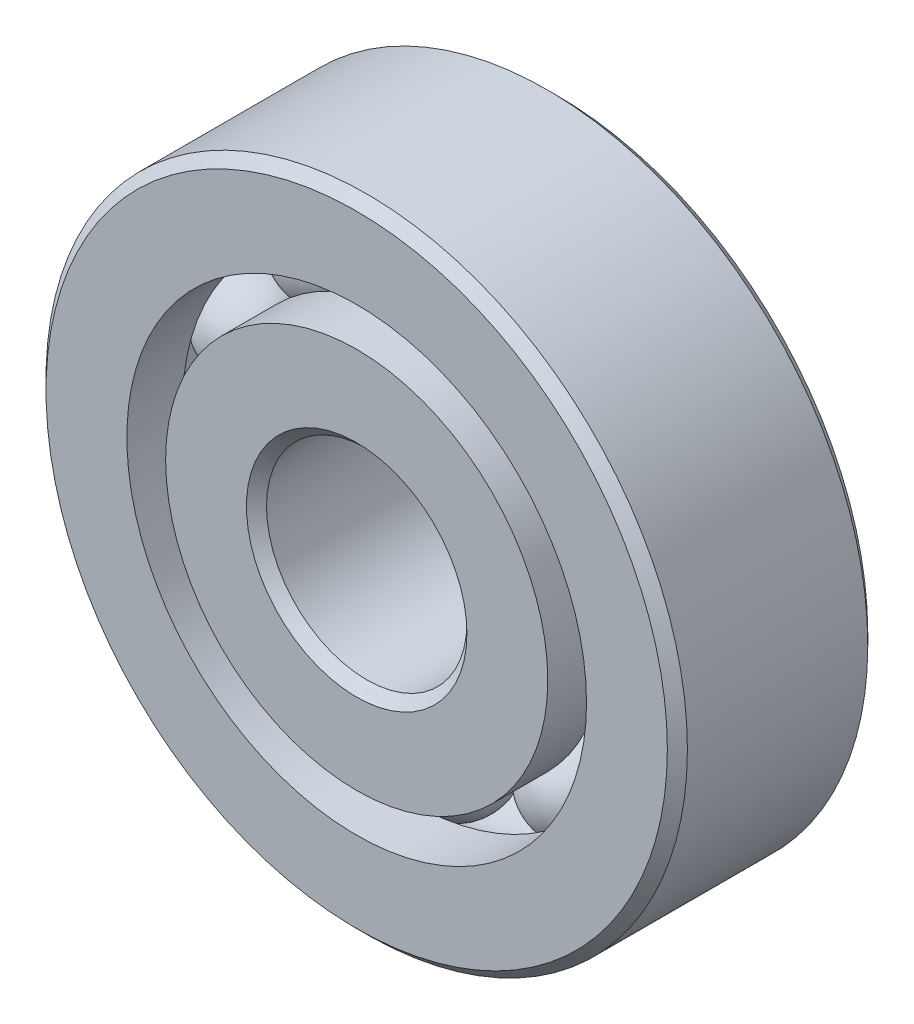
ISO-10303-21;
HEADER;
FILE_DESCRIPTION(('STEP AP214'),'2;1');
FILE_NAME('part.step','',(''),(''),'','','');
FILE_SCHEMA(('AUTOMOTIVE_DESIGN { 1 0 10303 214 1 1 1 1 }'));
ENDSEC;
DATA;
#1=APPLICATION_CONTEXT('core data for automotive mechanical design processes');
#2=APPLICATION_PROTOCOL_DEFINITION('international standard','automotive_design',2000,#1);
#3=PRODUCT_CONTEXT('',#1,'mechanical');
#4=PRODUCT('Part','Part','',(#3));
#5=PRODUCT_RELATED_PRODUCT_CATEGORY('part','',(#4));
#6=PRODUCT_DEFINITION_FORMATION('','',#4);
#7=PRODUCT_DEFINITION_CONTEXT('part definition',#1,'design');
#8=PRODUCT_DEFINITION('design','',#6,#7);
#9=PRODUCT_DEFINITION_SHAPE('','',#8);
#10=(LENGTH_UNIT() NAMED_UNIT(*) SI_UNIT(.MILLI.,.METRE.));
#11=(NAMED_UNIT(*) PLANE_ANGLE_UNIT() SI_UNIT($,.RADIAN.));
#12=(NAMED_UNIT(*) SI_UNIT($,.STERADIAN.) SOLID_ANGLE_UNIT());
#13=UNCERTAINTY_MEASURE_WITH_UNIT(LENGTH_MEASURE(1.E-05),#10,'distance_accuracy_value','');
#14=(GEOMETRIC_REPRESENTATION_CONTEXT(3) GLOBAL_UNCERTAINTY_ASSIGNED_CONTEXT((#13)) GLOBAL_UNIT_ASSIGNED_CONTEXT((#10,
#11,#12)) REPRESENTATION_CONTEXT('',''));
#15=CARTESIAN_POINT('',(0.,0.,0.));
#16=DIRECTION('',(0.,0.,1.));
#17=DIRECTION('',(1.,0.,0.));
#18=AXIS2_PLACEMENT_3D('',#15,#16,#17);
#19=CARTESIAN_POINT('',(-3.08587257453541,4.24733922046844,0.));
#20=DIRECTION('',(0.,0.,1.));
#21=DIRECTION('',(-0.587785252292463,0.809016994374955,0.));
#22=AXIS2_PLACEMENT_3D('',#19,#20,#21);
#23=SPHERICAL_SURFACE('',#22,1.21175743903915);
#24=CARTESIAN_POINT('',(-3.08587257453541,4.24733922046844,1.21175743903915));
#25=VERTEX_POINT('',#24);
#26=VERTEX_LOOP('',#25);
#27=FACE_BOUND('',#26,.T.);
#28=ADVANCED_FACE('F39',(#27),#23,.T.);
#29=CLOSED_SHELL('',(#28));
#30=MANIFOLD_SOLID_BREP('B2',#29);
#31=CARTESIAN_POINT('',(-4.99304671054945,1.62233922046853,0.));
#32=DIRECTION('',(0.,0.,1.));
#33=DIRECTION('',(-0.95105651629515,0.309016994374958,0.));
#34=AXIS2_PLACEMENT_3D('',#31,#32,#33);
#35=SPHERICAL_SURFACE('',#34,1.21175743903915);
#36=CARTESIAN_POINT('',(-4.99304671054945,1.62233922046853,1.21175743903915));
#37=VERTEX_POINT('',#36);
#38=VERTEX_LOOP('',#37);
#39=FACE_BOUND('',#38,.T.);
#40=ADVANCED_FACE('F57',(#39),#35,.T.);
#41=CLOSED_SHELL('',(#40));
#42=MANIFOLD_SOLID_BREP('B6',#41);
#43=CARTESIAN_POINT('',(-4.99304671054951,-1.62233922046848,0.));
#44=DIRECTION('',(0.,0.,1.));
#45=DIRECTION('',(-0.951056516295157,-0.309016994374938,0.));
#46=AXIS2_PLACEMENT_3D('',#43,#44,#45);
#47=SPHERICAL_SURFACE('',#46,1.21175743903915);
#48=CARTESIAN_POINT('',(-4.99304671054951,-1.62233922046848,1.21175743903915));
#49=VERTEX_POINT('',#48);
#50=VERTEX_LOOP('',#49);
#51=FACE_BOUND('',#50,.T.);
#52=ADVANCED_FACE('F75',(#51),#47,.T.);
#53=CLOSED_SHELL('',(#52));
#54=MANIFOLD_SOLID_BREP('B35',#53);
#55=CARTESIAN_POINT('',(-3.08587257453552,-4.24733922046844,0.));
#56=DIRECTION('',(0.,0.,1.));
#57=DIRECTION('',(-0.58778525229248,-0.809016994374942,0.));
#58=AXIS2_PLACEMENT_3D('',#55,#56,#57);
#59=SPHERICAL_SURFACE('',#58,1.21175743903915);
#60=CARTESIAN_POINT('',(-3.08587257453552,-4.24733922046844,1.21175743903915));
#61=VERTEX_POINT('',#60);
#62=VERTEX_LOOP('',#61);
#63=FACE_BOUND('',#62,.T.);
#64=ADVANCED_FACE('F93',(#63),#59,.T.);
#65=CLOSED_SHELL('',(#64));
#66=MANIFOLD_SOLID_BREP('B53',#65);
#67=CARTESIAN_POINT('',(0.,-5.25000000000003,0.));
#68=DIRECTION('',(0.,0.,1.));
#69=DIRECTION('',(0.,-1.,0.));
#70=AXIS2_PLACEMENT_3D('',#67,#68,#69);
#71=SPHERICAL_SURFACE('',#70,1.21175743903915);
#72=CARTESIAN_POINT('',(0.,-5.25000000000003,1.21175743903915));
#73=VERTEX_POINT('',#72);
#74=VERTEX_LOOP('',#73);
#75=FACE_BOUND('',#74,.T.);
#76=ADVANCED_FACE('F111',(#75),#71,.T.);
#77=CLOSED_SHELL('',(#76));
#78=MANIFOLD_SOLID_BREP('B71',#77);
#79=CARTESIAN_POINT('',(3.08587257453552,-4.24733922046847,0.));
#80=DIRECTION('',(0.,0.,1.));
#81=DIRECTION('',(0.587785252292469,-0.809016994374951,0.));
#82=AXIS2_PLACEMENT_3D('',#79,#80,#81);
#83=SPHERICAL_SURFACE('',#82,1.21175743903915);
#84=CARTESIAN_POINT('',(3.08587257453552,-4.24733922046847,1.21175743903915));
#85=VERTEX_POINT('',#84);
#86=VERTEX_LOOP('',#85);
#87=FACE_BOUND('',#86,.T.);
#88=ADVANCED_FACE('F129',(#87),#83,.T.);
#89=CLOSED_SHELL('',(#88));
#90=MANIFOLD_SOLID_BREP('B89',#89);
#91=CARTESIAN_POINT('',(4.99304671054962,-1.62233922046853,0.));
#92=DIRECTION('',(0.,0.,1.));
#93=DIRECTION('',(0.951056516295153,-0.309016994374952,0.));
#94=AXIS2_PLACEMENT_3D('',#91,#92,#93);
#95=SPHERICAL_SURFACE('',#94,1.21175743903915);
#96=CARTESIAN_POINT('',(4.99304671054962,-1.62233922046853,1.21175743903915));
#97=VERTEX_POINT('',#96);
#98=VERTEX_LOOP('',#97);
#99=FACE_BOUND('',#98,.T.);
#100=ADVANCED_FACE('F147',(#99),#95,.T.);
#101=CLOSED_SHELL('',(#100));
#102=MANIFOLD_SOLID_BREP('B107',#101);
#103=CARTESIAN_POINT('',(4.99304671054962,1.62233922046845,0.));
#104=DIRECTION('',(0.,0.,1.));
#105=DIRECTION('',(0.951056516295155,0.309016994374945,0.));
#106=AXIS2_PLACEMENT_3D('',#103,#104,#105);
#107=SPHERICAL_SURFACE('',#106,1.21175743903915);
#108=CARTESIAN_POINT('',(4.99304671054962,1.62233922046845,1.21175743903915));
#109=VERTEX_POINT('',#108);
#110=VERTEX_LOOP('',#109);
#111=FACE_BOUND('',#110,.T.);
#112=ADVANCED_FACE('F168',(#111),#107,.T.);
#113=CLOSED_SHELL('',(#112));
#114=MANIFOLD_SOLID_BREP('B125',#113);
#115=CARTESIAN_POINT('',(3.08587257453552,4.24733922046844,0.));
#116=DIRECTION('',(0.,0.,1.));
#117=DIRECTION('',(0.587785252292474,0.809016994374947,0.));
#118=AXIS2_PLACEMENT_3D('',#115,#116,#117);
#119=SPHERICAL_SURFACE('',#118,1.21175743903915);
#120=CARTESIAN_POINT('',(3.08587257453552,4.24733922046844,1.21175743903915));
#121=VERTEX_POINT('',#120);
#122=VERTEX_LOOP('',#121);
#123=FACE_BOUND('',#122,.T.);
#124=ADVANCED_FACE('F189',(#123),#119,.T.);
#125=CLOSED_SHELL('',(#124));
#126=MANIFOLD_SOLID_BREP('B143',#125);
#127=CARTESIAN_POINT('',(0.,5.24999999999998,0.));
#128=DIRECTION('',(0.,0.,1.));
#129=DIRECTION('',(0.,1.,0.));
#130=AXIS2_PLACEMENT_3D('',#127,#128,#129);
#131=SPHERICAL_SURFACE('',#130,1.21175743903915);
#132=CARTESIAN_POINT('',(0.,5.24999999999998,1.21175743903915));
#133=VERTEX_POINT('',#132);
#134=VERTEX_LOOP('',#133);
#135=FACE_BOUND('',#134,.T.);
#136=ADVANCED_FACE('F212',(#135),#131,.T.);
#137=CLOSED_SHELL('',(#136));
#138=MANIFOLD_SOLID_BREP('B164',#137);
#139=CARTESIAN_POINT('',(0.,4.76648351648354,2.5));
#140=DIRECTION('',(0.,0.,-1.));
#141=DIRECTION('',(-1.,0.,0.));
#142=AXIS2_PLACEMENT_3D('',#139,#140,#141);
#143=PLANE('',#142);
#144=CARTESIAN_POINT('',(0.,0.,2.5));
#145=DIRECTION('',(0.,0.,1.));
#146=DIRECTION('',(1.,0.,0.));
#147=AXIS2_PLACEMENT_3D('',#144,#145,#146);
#148=CIRCLE('',#147,2.75);
#149=CARTESIAN_POINT('',(2.75,0.,2.5));
#150=VERTEX_POINT('',#149);
#151=EDGE_CURVE('E260',#150,#150,#148,.T.);
#152=ORIENTED_EDGE('',*,*,#151,.F.);
#153=EDGE_LOOP('',(#152));
#154=FACE_BOUND('',#153,.T.);
#155=CARTESIAN_POINT('',(0.,0.,2.5));
#156=DIRECTION('',(0.,0.,1.));
#157=DIRECTION('',(1.,0.,0.));
#158=AXIS2_PLACEMENT_3D('',#155,#156,#157);
#159=CIRCLE('',#158,4.76648351648352);
#160=CARTESIAN_POINT('',(4.76648351648352,0.,2.5));
#161=VERTEX_POINT('',#160);
#162=EDGE_CURVE('E211',#161,#161,#159,.T.);
#163=ORIENTED_EDGE('',*,*,#162,.T.);
#164=EDGE_LOOP('',(#163));
#165=FACE_BOUND('',#164,.T.);
#166=ADVANCED_FACE('F232',(#154,#165),#143,.F.);
#167=CARTESIAN_POINT('',(0.,0.,2.5));
#168=DIRECTION('',(0.,0.,1.));
#169=DIRECTION('',(1.,0.,0.));
#170=AXIS2_PLACEMENT_3D('',#167,#168,#169);
#171=CYLINDRICAL_SURFACE('',#170,4.76648351648352);
#172=ORIENTED_EDGE('',*,*,#162,.F.);
#173=EDGE_LOOP('',(#172));
#174=FACE_BOUND('',#173,.T.);
#175=CARTESIAN_POINT('',(0.,0.,1.11111111111112));
#176=DIRECTION('',(0.,0.,1.));
#177=DIRECTION('',(1.,0.,0.));
#178=AXIS2_PLACEMENT_3D('',#175,#176,#177);
#179=CIRCLE('',#178,4.76648351648352);
#180=CARTESIAN_POINT('',(4.76648351648352,0.,1.11111111111112));
#181=VERTEX_POINT('',#180);
#182=EDGE_CURVE('E238',#181,#181,#179,.T.);
#183=ORIENTED_EDGE('',*,*,#182,.T.);
#184=EDGE_LOOP('',(#183));
#185=FACE_BOUND('',#184,.T.);
#186=ADVANCED_FACE('F267',(#174,#185),#171,.T.);
#187=CARTESIAN_POINT('',(0.,0.,0.));
#188=DIRECTION('',(0.,0.,1.));
#189=DIRECTION('',(1.,0.,0.));
#190=AXIS2_PLACEMENT_3D('',#187,#188,#189);
#191=TOROIDAL_SURFACE('',#190,5.25,1.21175743903915);
#192=ORIENTED_EDGE('',*,*,#182,.F.);
#193=EDGE_LOOP('',(#192));
#194=FACE_BOUND('',#193,.T.);
#195=CARTESIAN_POINT('',(0.,0.,-1.11111111111112));
#196=DIRECTION('',(0.,0.,1.));
#197=DIRECTION('',(1.,0.,0.));
#198=AXIS2_PLACEMENT_3D('',#195,#196,#197);
#199=CIRCLE('',#198,4.76648351648352);
#200=CARTESIAN_POINT('',(4.76648351648352,0.,-1.11111111111112));
#201=VERTEX_POINT('',#200);
#202=EDGE_CURVE('E242',#201,#201,#199,.T.);
#203=ORIENTED_EDGE('',*,*,#202,.T.);
#204=EDGE_LOOP('',(#203));
#205=FACE_BOUND('',#204,.T.);
#206=ADVANCED_FACE('F271',(#194,#205),#191,.F.);
#207=CARTESIAN_POINT('',(0.,0.,2.5));
#208=DIRECTION('',(0.,0.,1.));
#209=DIRECTION('',(1.,0.,0.));
#210=AXIS2_PLACEMENT_3D('',#207,#208,#209);
#211=CYLINDRICAL_SURFACE('',#210,4.76648351648352);
#212=ORIENTED_EDGE('',*,*,#202,.F.);
#213=EDGE_LOOP('',(#212));
#214=FACE_BOUND('',#213,.T.);
#215=CARTESIAN_POINT('',(0.,0.,-2.5));
#216=DIRECTION('',(0.,0.,1.));
#217=DIRECTION('',(1.,0.,0.));
#218=AXIS2_PLACEMENT_3D('',#215,#216,#217);
#219=CIRCLE('',#218,4.76648351648352);
#220=CARTESIAN_POINT('',(4.76648351648352,0.,-2.5));
#221=VERTEX_POINT('',#220);
#222=EDGE_CURVE('E246',#221,#221,#219,.T.);
#223=ORIENTED_EDGE('',*,*,#222,.T.);
#224=EDGE_LOOP('',(#223));
#225=FACE_BOUND('',#224,.T.);
#226=ADVANCED_FACE('F276',(#214,#225),#211,.T.);
#227=CARTESIAN_POINT('',(0.,2.74999999999992,-2.5));
#228=DIRECTION('',(0.,0.,1.));
#229=DIRECTION('',(1.,0.,0.));
#230=AXIS2_PLACEMENT_3D('',#227,#228,#229);
#231=PLANE('',#230);
#232=ORIENTED_EDGE('',*,*,#222,.F.);
#233=EDGE_LOOP('',(#232));
#234=FACE_BOUND('',#233,.T.);
#235=CARTESIAN_POINT('',(0.,0.,-2.5));
#236=DIRECTION('',(0.,0.,1.));
#237=DIRECTION('',(1.,0.,0.));
#238=AXIS2_PLACEMENT_3D('',#235,#236,#237);
#239=CIRCLE('',#238,2.75);
#240=CARTESIAN_POINT('',(2.75,0.,-2.5));
#241=VERTEX_POINT('',#240);
#242=EDGE_CURVE('E251',#241,#241,#239,.T.);
#243=ORIENTED_EDGE('',*,*,#242,.T.);
#244=EDGE_LOOP('',(#243));
#245=FACE_BOUND('',#244,.T.);
#246=ADVANCED_FACE('F282',(#234,#245),#231,.F.);
#247=CARTESIAN_POINT('',(0.,0.,-2.24999999999997));
#248=DIRECTION('',(0.,0.,-1.));
#249=DIRECTION('',(-1.,0.,0.));
#250=AXIS2_PLACEMENT_3D('',#247,#248,#249);
#251=CONICAL_SURFACE('',#250,2.5,0.785398163397444);
#252=ORIENTED_EDGE('',*,*,#242,.F.);
#253=EDGE_LOOP('',(#252));
#254=FACE_BOUND('',#253,.T.);
#255=CARTESIAN_POINT('',(0.,0.,-2.24999999999997));
#256=DIRECTION('',(0.,0.,1.));
#257=DIRECTION('',(1.,0.,0.));
#258=AXIS2_PLACEMENT_3D('',#255,#256,#257);
#259=CIRCLE('',#258,2.5);
#260=CARTESIAN_POINT('',(2.5,0.,-2.24999999999997));
#261=VERTEX_POINT('',#260);
#262=EDGE_CURVE('E254',#261,#261,#259,.T.);
#263=ORIENTED_EDGE('',*,*,#262,.T.);
#264=EDGE_LOOP('',(#263));
#265=FACE_BOUND('',#264,.T.);
#266=ADVANCED_FACE('F286',(#254,#265),#251,.F.);
#267=CARTESIAN_POINT('',(0.,0.,2.5));
#268=DIRECTION('',(0.,0.,1.));
#269=DIRECTION('',(1.,0.,0.));
#270=AXIS2_PLACEMENT_3D('',#267,#268,#269);
#271=CYLINDRICAL_SURFACE('',#270,2.5);
#272=ORIENTED_EDGE('',*,*,#262,.F.);
#273=EDGE_LOOP('',(#272));
#274=FACE_BOUND('',#273,.T.);
#275=CARTESIAN_POINT('',(0.,0.,2.24999999999997));
#276=DIRECTION('',(0.,0.,1.));
#277=DIRECTION('',(1.,0.,0.));
#278=AXIS2_PLACEMENT_3D('',#275,#276,#277);
#279=CIRCLE('',#278,2.5);
#280=CARTESIAN_POINT('',(2.5,0.,2.24999999999997));
#281=VERTEX_POINT('',#280);
#282=EDGE_CURVE('E257',#281,#281,#279,.T.);
#283=ORIENTED_EDGE('',*,*,#282,.T.);
#284=EDGE_LOOP('',(#283));
#285=FACE_BOUND('',#284,.T.);
#286=ADVANCED_FACE('F290',(#274,#285),#271,.F.);
#287=CARTESIAN_POINT('',(0.,0.,2.5));
#288=DIRECTION('',(0.,0.,1.));
#289=DIRECTION('',(1.,0.,0.));
#290=AXIS2_PLACEMENT_3D('',#287,#288,#289);
#291=CONICAL_SURFACE('',#290,2.75,0.785398163397453);
#292=ORIENTED_EDGE('',*,*,#282,.F.);
#293=EDGE_LOOP('',(#292));
#294=FACE_BOUND('',#293,.T.);
#295=ORIENTED_EDGE('',*,*,#151,.T.);
#296=EDGE_LOOP('',(#295));
#297=FACE_BOUND('',#296,.T.);
#298=ADVANCED_FACE('F264',(#294,#297),#291,.F.);
#299=CLOSED_SHELL('',(#166,#186,#206,#226,#246,#266,#286,#298));
#300=MANIFOLD_SOLID_BREP('B185',#299);
#301=CARTESIAN_POINT('',(0.,0.,2.24999999999997));
#302=DIRECTION('',(0.,0.,-1.));
#303=DIRECTION('',(-1.,0.,0.));
#304=AXIS2_PLACEMENT_3D('',#301,#302,#303);
#305=CONICAL_SURFACE('',#304,8.,0.785398163397445);
#306=CARTESIAN_POINT('',(0.,0.,2.5));
#307=DIRECTION('',(0.,0.,1.));
#308=DIRECTION('',(1.,0.,0.));
#309=AXIS2_PLACEMENT_3D('',#306,#307,#308);
#310=CIRCLE('',#309,7.75);
#311=CARTESIAN_POINT('',(7.75000000000001,0.,2.5));
#312=VERTEX_POINT('',#311);
#313=EDGE_CURVE('E365',#312,#312,#310,.T.);
#314=ORIENTED_EDGE('',*,*,#313,.F.);
#315=EDGE_LOOP('',(#314));
#316=FACE_BOUND('',#315,.T.);
#317=CARTESIAN_POINT('',(0.,0.,2.24999999999997));
#318=DIRECTION('',(0.,0.,1.));
#319=DIRECTION('',(1.,0.,0.));
#320=AXIS2_PLACEMENT_3D('',#317,#318,#319);
#321=CIRCLE('',#320,8.);
#322=CARTESIAN_POINT('',(8.,0.,2.24999999999997));
#323=VERTEX_POINT('',#322);
#324=EDGE_CURVE('E231',#323,#323,#321,.T.);
#325=ORIENTED_EDGE('',*,*,#324,.T.);
#326=EDGE_LOOP('',(#325));
#327=FACE_BOUND('',#326,.T.);
#328=ADVANCED_FACE('F337',(#316,#327),#305,.T.);
#329=CARTESIAN_POINT('',(0.,0.,2.5));
#330=DIRECTION('',(0.,0.,1.));
#331=DIRECTION('',(1.,0.,0.));
#332=AXIS2_PLACEMENT_3D('',#329,#330,#331);
#333=CYLINDRICAL_SURFACE('',#332,8.);
#334=ORIENTED_EDGE('',*,*,#324,.F.);
#335=EDGE_LOOP('',(#334));
#336=FACE_BOUND('',#335,.T.);
#337=CARTESIAN_POINT('',(0.,0.,-2.24999999999997));
#338=DIRECTION('',(0.,0.,1.));
#339=DIRECTION('',(1.,0.,0.));
#340=AXIS2_PLACEMENT_3D('',#337,#338,#339);
#341=CIRCLE('',#340,8.);
#342=CARTESIAN_POINT('',(8.,0.,-2.24999999999997));
#343=VERTEX_POINT('',#342);
#344=EDGE_CURVE('E343',#343,#343,#341,.T.);
#345=ORIENTED_EDGE('',*,*,#344,.T.);
#346=EDGE_LOOP('',(#345));
#347=FACE_BOUND('',#346,.T.);
#348=ADVANCED_FACE('F372',(#336,#347),#333,.T.);
#349=CARTESIAN_POINT('',(0.,0.,-2.5));
#350=DIRECTION('',(0.,0.,1.));
#351=DIRECTION('',(1.,0.,0.));
#352=AXIS2_PLACEMENT_3D('',#349,#350,#351);
#353=CONICAL_SURFACE('',#352,7.75,0.785398163397443);
#354=ORIENTED_EDGE('',*,*,#344,.F.);
#355=EDGE_LOOP('',(#354));
#356=FACE_BOUND('',#355,.T.);
#357=CARTESIAN_POINT('',(0.,0.,-2.5));
#358=DIRECTION('',(0.,0.,1.));
#359=DIRECTION('',(1.,0.,0.));
#360=AXIS2_PLACEMENT_3D('',#357,#358,#359);
#361=CIRCLE('',#360,7.75);
#362=CARTESIAN_POINT('',(7.75000000000001,0.,-2.5));
#363=VERTEX_POINT('',#362);
#364=EDGE_CURVE('E347',#363,#363,#361,.T.);
#365=ORIENTED_EDGE('',*,*,#364,.T.);
#366=EDGE_LOOP('',(#365));
#367=FACE_BOUND('',#366,.T.);
#368=ADVANCED_FACE('F376',(#356,#367),#353,.T.);
#369=CARTESIAN_POINT('',(0.,7.74999999999998,-2.5));
#370=DIRECTION('',(0.,0.,1.));
#371=DIRECTION('',(1.,0.,0.));
#372=AXIS2_PLACEMENT_3D('',#369,#370,#371);
#373=PLANE('',#372);
#374=ORIENTED_EDGE('',*,*,#364,.F.);
#375=EDGE_LOOP('',(#374));
#376=FACE_BOUND('',#375,.T.);
#377=CARTESIAN_POINT('',(0.,0.,-2.5));
#378=DIRECTION('',(0.,0.,1.));
#379=DIRECTION('',(1.,0.,0.));
#380=AXIS2_PLACEMENT_3D('',#377,#378,#379);
#381=CIRCLE('',#380,5.73351648351648);
#382=CARTESIAN_POINT('',(5.73351648351649,0.,-2.5));
#383=VERTEX_POINT('',#382);
#384=EDGE_CURVE('E351',#383,#383,#381,.T.);
#385=ORIENTED_EDGE('',*,*,#384,.T.);
#386=EDGE_LOOP('',(#385));
#387=FACE_BOUND('',#386,.T.);
#388=ADVANCED_FACE('F381',(#376,#387),#373,.F.);
#389=CARTESIAN_POINT('',(0.,0.,2.5));
#390=DIRECTION('',(0.,0.,1.));
#391=DIRECTION('',(1.,0.,0.));
#392=AXIS2_PLACEMENT_3D('',#389,#390,#391);
#393=CYLINDRICAL_SURFACE('',#392,5.73351648351648);
#394=ORIENTED_EDGE('',*,*,#384,.F.);
#395=EDGE_LOOP('',(#394));
#396=FACE_BOUND('',#395,.T.);
#397=CARTESIAN_POINT('',(0.,0.,-1.11111111111112));
#398=DIRECTION('',(0.,0.,1.));
#399=DIRECTION('',(1.,0.,0.));
#400=AXIS2_PLACEMENT_3D('',#397,#398,#399);
#401=CIRCLE('',#400,5.73351648351648);
#402=CARTESIAN_POINT('',(5.73351648351649,0.,-1.11111111111112));
#403=VERTEX_POINT('',#402);
#404=EDGE_CURVE('E356',#403,#403,#401,.T.);
#405=ORIENTED_EDGE('',*,*,#404,.T.);
#406=EDGE_LOOP('',(#405));
#407=FACE_BOUND('',#406,.T.);
#408=ADVANCED_FACE('F387',(#396,#407),#393,.F.);
#409=CARTESIAN_POINT('',(0.,0.,0.));
#410=DIRECTION('',(0.,0.,1.));
#411=DIRECTION('',(1.,0.,0.));
#412=AXIS2_PLACEMENT_3D('',#409,#410,#411);
#413=TOROIDAL_SURFACE('',#412,5.25,1.21175743903915);
#414=ORIENTED_EDGE('',*,*,#404,.F.);
#415=EDGE_LOOP('',(#414));
#416=FACE_BOUND('',#415,.T.);
#417=CARTESIAN_POINT('',(0.,0.,1.11111111111112));
#418=DIRECTION('',(0.,0.,1.));
#419=DIRECTION('',(1.,0.,0.));
#420=AXIS2_PLACEMENT_3D('',#417,#418,#419);
#421=CIRCLE('',#420,5.73351648351648);
#422=CARTESIAN_POINT('',(5.73351648351649,0.,1.11111111111112));
#423=VERTEX_POINT('',#422);
#424=EDGE_CURVE('E359',#423,#423,#421,.T.);
#425=ORIENTED_EDGE('',*,*,#424,.T.);
#426=EDGE_LOOP('',(#425));
#427=FACE_BOUND('',#426,.T.);
#428=ADVANCED_FACE('F391',(#416,#427),#413,.F.);
#429=CARTESIAN_POINT('',(0.,0.,2.5));
#430=DIRECTION('',(0.,0.,1.));
#431=DIRECTION('',(1.,0.,0.));
#432=AXIS2_PLACEMENT_3D('',#429,#430,#431);
#433=CYLINDRICAL_SURFACE('',#432,5.73351648351648);
#434=ORIENTED_EDGE('',*,*,#424,.F.);
#435=EDGE_LOOP('',(#434));
#436=FACE_BOUND('',#435,.T.);
#437=CARTESIAN_POINT('',(0.,0.,2.5));
#438=DIRECTION('',(0.,0.,1.));
#439=DIRECTION('',(1.,0.,0.));
#440=AXIS2_PLACEMENT_3D('',#437,#438,#439);
#441=CIRCLE('',#440,5.73351648351648);
#442=CARTESIAN_POINT('',(5.73351648351649,0.,2.5));
#443=VERTEX_POINT('',#442);
#444=EDGE_CURVE('E362',#443,#443,#441,.T.);
#445=ORIENTED_EDGE('',*,*,#444,.T.);
#446=EDGE_LOOP('',(#445));
#447=FACE_BOUND('',#446,.T.);
#448=ADVANCED_FACE('F395',(#436,#447),#433,.F.);
#449=CARTESIAN_POINT('',(0.,7.74999999999998,2.5));
#450=DIRECTION('',(0.,0.,-1.));
#451=DIRECTION('',(-1.,0.,0.));
#452=AXIS2_PLACEMENT_3D('',#449,#450,#451);
#453=PLANE('',#452);
#454=ORIENTED_EDGE('',*,*,#444,.F.);
#455=EDGE_LOOP('',(#454));
#456=FACE_BOUND('',#455,.T.);
#457=ORIENTED_EDGE('',*,*,#313,.T.);
#458=EDGE_LOOP('',(#457));
#459=FACE_BOUND('',#458,.T.);
#460=ADVANCED_FACE('F369',(#456,#459),#453,.F.);
#461=CLOSED_SHELL('',(#328,#348,#368,#388,#408,#428,#448,#460));
#462=MANIFOLD_SOLID_BREP('B206',#461);
#463=ADVANCED_BREP_SHAPE_REPRESENTATION('',(#18,#30,#42,#54,#66,#78,#90,#102,#114,#126,#138,
#300,#462),#14);
#464=SHAPE_DEFINITION_REPRESENTATION(#9,#463);
ENDSEC;
END-ISO-10303-21;
